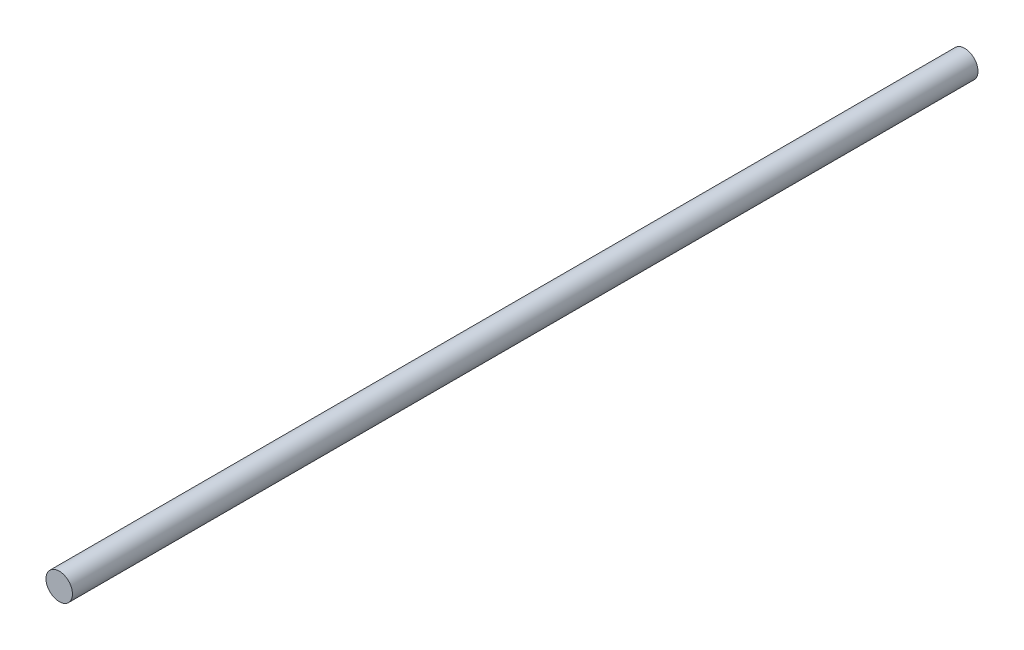
ISO-10303-21;
HEADER;
FILE_DESCRIPTION(('STEP AP214'),'2;1');
FILE_NAME('part.step','',(''),(''),'','','');
FILE_SCHEMA(('AUTOMOTIVE_DESIGN { 1 0 10303 214 1 1 1 1 }'));
ENDSEC;
DATA;
#1=APPLICATION_CONTEXT('core data for automotive mechanical design processes');
#2=APPLICATION_PROTOCOL_DEFINITION('international standard','automotive_design',2000,#1);
#3=PRODUCT_CONTEXT('',#1,'mechanical');
#4=PRODUCT('Part','Part','',(#3));
#5=PRODUCT_RELATED_PRODUCT_CATEGORY('part','',(#4));
#6=PRODUCT_DEFINITION_FORMATION('','',#4);
#7=PRODUCT_DEFINITION_CONTEXT('part definition',#1,'design');
#8=PRODUCT_DEFINITION('design','',#6,#7);
#9=PRODUCT_DEFINITION_SHAPE('','',#8);
#10=(LENGTH_UNIT() NAMED_UNIT(*) SI_UNIT(.MILLI.,.METRE.));
#11=(NAMED_UNIT(*) PLANE_ANGLE_UNIT() SI_UNIT($,.RADIAN.));
#12=(NAMED_UNIT(*) SI_UNIT($,.STERADIAN.) SOLID_ANGLE_UNIT());
#13=UNCERTAINTY_MEASURE_WITH_UNIT(LENGTH_MEASURE(1.E-05),#10,'distance_accuracy_value','');
#14=(GEOMETRIC_REPRESENTATION_CONTEXT(3) GLOBAL_UNCERTAINTY_ASSIGNED_CONTEXT((#13)) GLOBAL_UNIT_ASSIGNED_CONTEXT((#10,
#11,#12)) REPRESENTATION_CONTEXT('',''));
#15=CARTESIAN_POINT('',(0.,0.,0.));
#16=DIRECTION('',(0.,0.,1.));
#17=DIRECTION('',(1.,0.,0.));
#18=AXIS2_PLACEMENT_3D('',#15,#16,#17);
#19=CARTESIAN_POINT('',(0.,0.,270.));
#20=DIRECTION('',(0.,0.,-1.));
#21=DIRECTION('',(-1.,0.,0.));
#22=AXIS2_PLACEMENT_3D('',#19,#20,#21);
#23=CYLINDRICAL_SURFACE('',#22,3.95);
#24=CARTESIAN_POINT('',(0.,0.,270.));
#25=DIRECTION('',(0.,0.,1.));
#26=DIRECTION('',(1.,0.,0.));
#27=AXIS2_PLACEMENT_3D('',#24,#25,#26);
#28=CIRCLE('',#27,3.95);
#29=CARTESIAN_POINT('',(3.95,0.,270.));
#30=VERTEX_POINT('',#29);
#31=EDGE_CURVE('E10',#30,#30,#28,.T.);
#32=ORIENTED_EDGE('',*,*,#31,.F.);
#33=EDGE_LOOP('',(#32));
#34=FACE_BOUND('',#33,.T.);
#35=CARTESIAN_POINT('',(0.,0.,0.));
#36=DIRECTION('',(0.,0.,1.));
#37=DIRECTION('',(1.,0.,0.));
#38=AXIS2_PLACEMENT_3D('',#35,#36,#37);
#39=CIRCLE('',#38,3.95);
#40=CARTESIAN_POINT('',(3.95,0.,0.));
#41=VERTEX_POINT('',#40);
#42=EDGE_CURVE('E43',#41,#41,#39,.T.);
#43=ORIENTED_EDGE('',*,*,#42,.T.);
#44=EDGE_LOOP('',(#43));
#45=FACE_BOUND('',#44,.T.);
#46=ADVANCED_FACE('F40',(#34,#45),#23,.T.);
#47=CARTESIAN_POINT('',(0.,0.,270.));
#48=DIRECTION('',(0.,0.,1.));
#49=DIRECTION('',(1.,0.,0.));
#50=AXIS2_PLACEMENT_3D('',#47,#48,#49);
#51=PLANE('',#50);
#52=ORIENTED_EDGE('',*,*,#31,.T.);
#53=EDGE_LOOP('',(#52));
#54=FACE_BOUND('',#53,.T.);
#55=ADVANCED_FACE('F57',(#54),#51,.T.);
#56=CARTESIAN_POINT('',(0.,0.,0.));
#57=DIRECTION('',(0.,0.,1.));
#58=DIRECTION('',(1.,0.,0.));
#59=AXIS2_PLACEMENT_3D('',#56,#57,#58);
#60=PLANE('',#59);
#61=ORIENTED_EDGE('',*,*,#42,.F.);
#62=EDGE_LOOP('',(#61));
#63=FACE_BOUND('',#62,.T.);
#64=ADVANCED_FACE('F55',(#63),#60,.F.);
#65=CLOSED_SHELL('',(#46,#55,#64));
#66=MANIFOLD_SOLID_BREP('B2',#65);
#67=ADVANCED_BREP_SHAPE_REPRESENTATION('',(#18,#66),#14);
#68=SHAPE_DEFINITION_REPRESENTATION(#9,#67);
ENDSEC;
END-ISO-10303-21;
